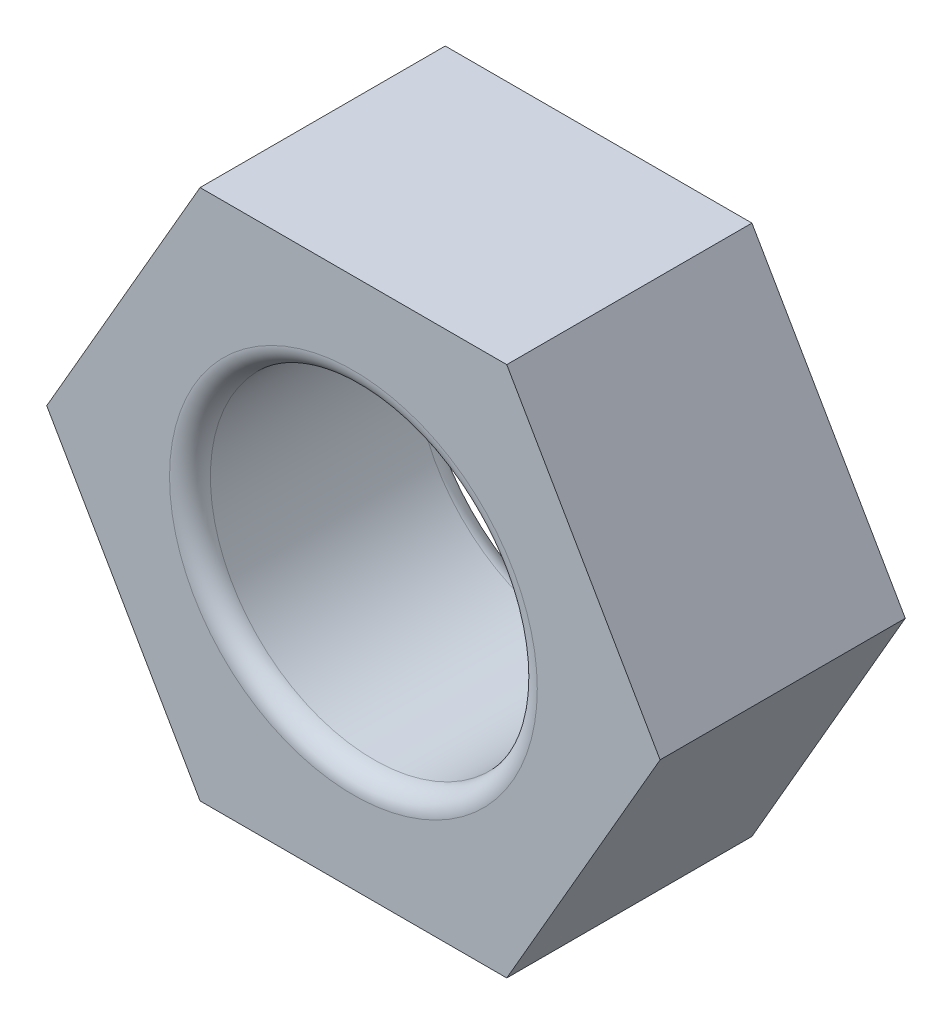
ISO-10303-21;
HEADER;
FILE_DESCRIPTION(('STEP AP214'),'2;1');
FILE_NAME('part.step','',(''),(''),'','','');
FILE_SCHEMA(('AUTOMOTIVE_DESIGN { 1 0 10303 214 1 1 1 1 }'));
ENDSEC;
DATA;
#1=APPLICATION_CONTEXT('core data for automotive mechanical design processes');
#2=APPLICATION_PROTOCOL_DEFINITION('international standard','automotive_design',2000,#1);
#3=PRODUCT_CONTEXT('',#1,'mechanical');
#4=PRODUCT('Part','Part','',(#3));
#5=PRODUCT_RELATED_PRODUCT_CATEGORY('part','',(#4));
#6=PRODUCT_DEFINITION_FORMATION('','',#4);
#7=PRODUCT_DEFINITION_CONTEXT('part definition',#1,'design');
#8=PRODUCT_DEFINITION('design','',#6,#7);
#9=PRODUCT_DEFINITION_SHAPE('','',#8);
#10=(LENGTH_UNIT() NAMED_UNIT(*) SI_UNIT(.MILLI.,.METRE.));
#11=(NAMED_UNIT(*) PLANE_ANGLE_UNIT() SI_UNIT($,.RADIAN.));
#12=(NAMED_UNIT(*) SI_UNIT($,.STERADIAN.) SOLID_ANGLE_UNIT());
#13=UNCERTAINTY_MEASURE_WITH_UNIT(LENGTH_MEASURE(1.E-05),#10,'distance_accuracy_value','');
#14=(GEOMETRIC_REPRESENTATION_CONTEXT(3) GLOBAL_UNCERTAINTY_ASSIGNED_CONTEXT((#13)) GLOBAL_UNIT_ASSIGNED_CONTEXT((#10,
#11,#12)) REPRESENTATION_CONTEXT('',''));
#15=CARTESIAN_POINT('',(0.,0.,0.));
#16=DIRECTION('',(0.,0.,1.));
#17=DIRECTION('',(1.,0.,0.));
#18=AXIS2_PLACEMENT_3D('',#15,#16,#17);
#19=CARTESIAN_POINT('',(-7.50555349946511,0.,6.));
#20=DIRECTION('',(0.,0.,1.));
#21=DIRECTION('',(1.,0.,0.));
#22=AXIS2_PLACEMENT_3D('',#19,#20,#21);
#23=PLANE('',#22);
#24=CARTESIAN_POINT('',(0.,0.,6.));
#25=DIRECTION('',(0.,0.,1.));
#26=DIRECTION('',(1.,0.,0.));
#27=AXIS2_PLACEMENT_3D('',#24,#25,#26);
#28=CIRCLE('',#27,4.5);
#29=CARTESIAN_POINT('',(4.5,0.,6.));
#30=VERTEX_POINT('',#29);
#31=EDGE_CURVE('E11',#30,#30,#28,.F.);
#32=ORIENTED_EDGE('',*,*,#31,.T.);
#33=EDGE_LOOP('',(#32));
#34=FACE_BOUND('',#33,.T.);
#35=DIRECTION('',(-0.500000000000007,-0.866025403784434,0.));
#36=VECTOR('',#35,1.);
#37=CARTESIAN_POINT('',(-3.75277674973252,6.5,6.));
#38=LINE('',#37,#36);
#39=CARTESIAN_POINT('',(-3.75277674973252,6.5,6.));
#40=VERTEX_POINT('',#39);
#41=CARTESIAN_POINT('',(-7.50555349946511,0.,6.));
#42=VERTEX_POINT('',#41);
#43=EDGE_CURVE('E125',#40,#42,#38,.T.);
#44=ORIENTED_EDGE('',*,*,#43,.T.);
#45=DIRECTION('',(0.499999999999998,-0.86602540378444,0.));
#46=VECTOR('',#45,1.);
#47=CARTESIAN_POINT('',(-7.50555349946511,0.,6.));
#48=LINE('',#47,#46);
#49=CARTESIAN_POINT('',(-3.75277674973253,-6.49999999999997,6.));
#50=VERTEX_POINT('',#49);
#51=EDGE_CURVE('E85',#42,#50,#48,.T.);
#52=ORIENTED_EDGE('',*,*,#51,.T.);
#53=DIRECTION('',(1.,0.,0.));
#54=VECTOR('',#53,1.);
#55=CARTESIAN_POINT('',(-3.75277674973253,-6.49999999999997,6.));
#56=LINE('',#55,#54);
#57=CARTESIAN_POINT('',(3.75277674973263,-6.49999999999986,6.));
#58=VERTEX_POINT('',#57);
#59=EDGE_CURVE('E97',#50,#58,#56,.T.);
#60=ORIENTED_EDGE('',*,*,#59,.T.);
#61=DIRECTION('',(0.500000000000013,0.866025403784431,0.));
#62=VECTOR('',#61,1.);
#63=CARTESIAN_POINT('',(3.75277674973263,-6.49999999999986,6.));
#64=LINE('',#63,#62);
#65=CARTESIAN_POINT('',(7.5055534994653,0.,6.));
#66=VERTEX_POINT('',#65);
#67=EDGE_CURVE('E92',#58,#66,#64,.T.);
#68=ORIENTED_EDGE('',*,*,#67,.T.);
#69=DIRECTION('',(-0.5,0.866025403784439,0.));
#70=VECTOR('',#69,1.);
#71=CARTESIAN_POINT('',(7.5055534994653,0.,6.));
#72=LINE('',#71,#70);
#73=CARTESIAN_POINT('',(3.7527767497327,6.50000000000014,6.));
#74=VERTEX_POINT('',#73);
#75=EDGE_CURVE('E95',#66,#74,#72,.T.);
#76=ORIENTED_EDGE('',*,*,#75,.T.);
#77=DIRECTION('',(-1.,0.,0.));
#78=VECTOR('',#77,1.);
#79=CARTESIAN_POINT('',(3.7527767497327,6.50000000000014,6.));
#80=LINE('',#79,#78);
#81=EDGE_CURVE('E47',#74,#40,#80,.T.);
#82=ORIENTED_EDGE('',*,*,#81,.T.);
#83=EDGE_LOOP('',(#44,#52,#60,#68,#76,#82));
#84=FACE_BOUND('',#83,.T.);
#85=ADVANCED_FACE('F30',(#34,#84),#23,.T.);
#86=CARTESIAN_POINT('',(-7.50555349946511,0.,0.));
#87=DIRECTION('',(0.,0.,1.));
#88=DIRECTION('',(1.,0.,0.));
#89=AXIS2_PLACEMENT_3D('',#86,#87,#88);
#90=PLANE('',#89);
#91=CARTESIAN_POINT('',(0.,0.,0.));
#92=DIRECTION('',(0.,0.,1.));
#93=DIRECTION('',(1.,0.,0.));
#94=AXIS2_PLACEMENT_3D('',#91,#92,#93);
#95=CIRCLE('',#94,4.5);
#96=CARTESIAN_POINT('',(4.5,0.,0.));
#97=VERTEX_POINT('',#96);
#98=EDGE_CURVE('E134',#97,#97,#95,.T.);
#99=ORIENTED_EDGE('',*,*,#98,.T.);
#100=EDGE_LOOP('',(#99));
#101=FACE_BOUND('',#100,.T.);
#102=DIRECTION('',(-0.500000000000007,-0.866025403784434,0.));
#103=VECTOR('',#102,1.);
#104=CARTESIAN_POINT('',(-3.75277674973252,6.5,0.));
#105=LINE('',#104,#103);
#106=CARTESIAN_POINT('',(-3.75277674973252,6.5,0.));
#107=VERTEX_POINT('',#106);
#108=CARTESIAN_POINT('',(-7.50555349946511,0.,0.));
#109=VERTEX_POINT('',#108);
#110=EDGE_CURVE('E115',#107,#109,#105,.T.);
#111=ORIENTED_EDGE('',*,*,#110,.F.);
#112=DIRECTION('',(-1.,0.,0.));
#113=VECTOR('',#112,1.);
#114=CARTESIAN_POINT('',(3.7527767497327,6.50000000000014,0.));
#115=LINE('',#114,#113);
#116=CARTESIAN_POINT('',(3.7527767497327,6.50000000000014,0.));
#117=VERTEX_POINT('',#116);
#118=EDGE_CURVE('E76',#117,#107,#115,.T.);
#119=ORIENTED_EDGE('',*,*,#118,.F.);
#120=DIRECTION('',(-0.5,0.866025403784439,0.));
#121=VECTOR('',#120,1.);
#122=CARTESIAN_POINT('',(7.5055534994653,0.,0.));
#123=LINE('',#122,#121);
#124=CARTESIAN_POINT('',(7.5055534994653,0.,0.));
#125=VERTEX_POINT('',#124);
#126=EDGE_CURVE('E70',#125,#117,#123,.T.);
#127=ORIENTED_EDGE('',*,*,#126,.F.);
#128=DIRECTION('',(0.500000000000013,0.866025403784431,0.));
#129=VECTOR('',#128,1.);
#130=CARTESIAN_POINT('',(3.75277674973263,-6.49999999999986,0.));
#131=LINE('',#130,#129);
#132=CARTESIAN_POINT('',(3.75277674973263,-6.49999999999986,0.));
#133=VERTEX_POINT('',#132);
#134=EDGE_CURVE('E105',#133,#125,#131,.T.);
#135=ORIENTED_EDGE('',*,*,#134,.F.);
#136=DIRECTION('',(1.,0.,0.));
#137=VECTOR('',#136,1.);
#138=CARTESIAN_POINT('',(-3.75277674973253,-6.49999999999997,0.));
#139=LINE('',#138,#137);
#140=CARTESIAN_POINT('',(-3.75277674973253,-6.49999999999997,0.));
#141=VERTEX_POINT('',#140);
#142=EDGE_CURVE('E120',#141,#133,#139,.T.);
#143=ORIENTED_EDGE('',*,*,#142,.F.);
#144=DIRECTION('',(0.499999999999998,-0.86602540378444,0.));
#145=VECTOR('',#144,1.);
#146=CARTESIAN_POINT('',(-7.50555349946511,0.,0.));
#147=LINE('',#146,#145);
#148=EDGE_CURVE('E118',#109,#141,#147,.T.);
#149=ORIENTED_EDGE('',*,*,#148,.F.);
#150=EDGE_LOOP('',(#111,#119,#127,#135,#143,#149));
#151=FACE_BOUND('',#150,.T.);
#152=ADVANCED_FACE('F150',(#101,#151),#90,.F.);
#153=CARTESIAN_POINT('',(-3.75277674973252,6.5,6.));
#154=DIRECTION('',(0.866025403784434,-0.500000000000007,0.));
#155=DIRECTION('',(0.500000000000007,0.866025403784435,0.));
#156=AXIS2_PLACEMENT_3D('',#153,#154,#155);
#157=PLANE('',#156);
#158=ORIENTED_EDGE('',*,*,#110,.T.);
#159=DIRECTION('',(0.,0.,-1.));
#160=VECTOR('',#159,1.);
#161=CARTESIAN_POINT('',(-7.50555349946511,0.,6.));
#162=LINE('',#161,#160);
#163=EDGE_CURVE('E132',#42,#109,#162,.T.);
#164=ORIENTED_EDGE('',*,*,#163,.F.);
#165=ORIENTED_EDGE('',*,*,#43,.F.);
#166=DIRECTION('',(0.,0.,-1.));
#167=VECTOR('',#166,1.);
#168=CARTESIAN_POINT('',(-3.75277674973252,6.5,6.));
#169=LINE('',#168,#167);
#170=EDGE_CURVE('E111',#40,#107,#169,.T.);
#171=ORIENTED_EDGE('',*,*,#170,.T.);
#172=EDGE_LOOP('',(#158,#164,#165,#171));
#173=FACE_BOUND('',#172,.T.);
#174=ADVANCED_FACE('F153',(#173),#157,.F.);
#175=CARTESIAN_POINT('',(-7.50555349946511,0.,6.));
#176=DIRECTION('',(0.86602540378444,0.499999999999998,0.));
#177=DIRECTION('',(-0.499999999999998,0.86602540378444,0.));
#178=AXIS2_PLACEMENT_3D('',#175,#176,#177);
#179=PLANE('',#178);
#180=ORIENTED_EDGE('',*,*,#148,.T.);
#181=DIRECTION('',(0.,0.,-1.));
#182=VECTOR('',#181,1.);
#183=CARTESIAN_POINT('',(-3.75277674973253,-6.49999999999997,6.));
#184=LINE('',#183,#182);
#185=EDGE_CURVE('E129',#50,#141,#184,.T.);
#186=ORIENTED_EDGE('',*,*,#185,.F.);
#187=ORIENTED_EDGE('',*,*,#51,.F.);
#188=ORIENTED_EDGE('',*,*,#163,.T.);
#189=EDGE_LOOP('',(#180,#186,#187,#188));
#190=FACE_BOUND('',#189,.T.);
#191=ADVANCED_FACE('F229',(#190),#179,.F.);
#192=CARTESIAN_POINT('',(-3.75277674973253,-6.49999999999997,6.));
#193=DIRECTION('',(0.,1.,0.));
#194=DIRECTION('',(-1.,0.,0.));
#195=AXIS2_PLACEMENT_3D('',#192,#193,#194);
#196=PLANE('',#195);
#197=ORIENTED_EDGE('',*,*,#142,.T.);
#198=DIRECTION('',(0.,0.,-1.));
#199=VECTOR('',#198,1.);
#200=CARTESIAN_POINT('',(3.75277674973263,-6.49999999999986,6.));
#201=LINE('',#200,#199);
#202=EDGE_CURVE('E106',#58,#133,#201,.T.);
#203=ORIENTED_EDGE('',*,*,#202,.F.);
#204=ORIENTED_EDGE('',*,*,#59,.F.);
#205=ORIENTED_EDGE('',*,*,#185,.T.);
#206=EDGE_LOOP('',(#197,#203,#204,#205));
#207=FACE_BOUND('',#206,.T.);
#208=ADVANCED_FACE('F220',(#207),#196,.F.);
#209=CARTESIAN_POINT('',(3.75277674973263,-6.49999999999986,6.));
#210=DIRECTION('',(-0.866025403784431,0.500000000000013,0.));
#211=DIRECTION('',(-0.500000000000013,-0.866025403784431,0.));
#212=AXIS2_PLACEMENT_3D('',#209,#210,#211);
#213=PLANE('',#212);
#214=ORIENTED_EDGE('',*,*,#134,.T.);
#215=DIRECTION('',(0.,0.,-1.));
#216=VECTOR('',#215,1.);
#217=CARTESIAN_POINT('',(7.5055534994653,0.,6.));
#218=LINE('',#217,#216);
#219=EDGE_CURVE('E102',#66,#125,#218,.T.);
#220=ORIENTED_EDGE('',*,*,#219,.F.);
#221=ORIENTED_EDGE('',*,*,#67,.F.);
#222=ORIENTED_EDGE('',*,*,#202,.T.);
#223=EDGE_LOOP('',(#214,#220,#221,#222));
#224=FACE_BOUND('',#223,.T.);
#225=ADVANCED_FACE('F103',(#224),#213,.F.);
#226=CARTESIAN_POINT('',(7.5055534994653,0.,6.));
#227=DIRECTION('',(-0.866025403784439,-0.5,0.));
#228=DIRECTION('',(0.5,-0.866025403784439,0.));
#229=AXIS2_PLACEMENT_3D('',#226,#227,#228);
#230=PLANE('',#229);
#231=ORIENTED_EDGE('',*,*,#126,.T.);
#232=DIRECTION('',(0.,0.,-1.));
#233=VECTOR('',#232,1.);
#234=CARTESIAN_POINT('',(3.7527767497327,6.50000000000014,6.));
#235=LINE('',#234,#233);
#236=EDGE_CURVE('E107',#74,#117,#235,.T.);
#237=ORIENTED_EDGE('',*,*,#236,.F.);
#238=ORIENTED_EDGE('',*,*,#75,.F.);
#239=ORIENTED_EDGE('',*,*,#219,.T.);
#240=EDGE_LOOP('',(#231,#237,#238,#239));
#241=FACE_BOUND('',#240,.T.);
#242=ADVANCED_FACE('F109',(#241),#230,.F.);
#243=CARTESIAN_POINT('',(3.7527767497327,6.50000000000014,6.));
#244=DIRECTION('',(0.,-1.,0.));
#245=DIRECTION('',(1.,0.,0.));
#246=AXIS2_PLACEMENT_3D('',#243,#244,#245);
#247=PLANE('',#246);
#248=ORIENTED_EDGE('',*,*,#118,.T.);
#249=ORIENTED_EDGE('',*,*,#170,.F.);
#250=ORIENTED_EDGE('',*,*,#81,.F.);
#251=ORIENTED_EDGE('',*,*,#236,.T.);
#252=EDGE_LOOP('',(#248,#249,#250,#251));
#253=FACE_BOUND('',#252,.T.);
#254=ADVANCED_FACE('F160',(#253),#247,.F.);
#255=CARTESIAN_POINT('',(0.,0.,6.));
#256=DIRECTION('',(0.,0.,-1.));
#257=DIRECTION('',(-1.,0.,0.));
#258=AXIS2_PLACEMENT_3D('',#255,#256,#257);
#259=CYLINDRICAL_SURFACE('',#258,4.);
#260=CARTESIAN_POINT('',(0.,0.,0.5));
#261=DIRECTION('',(0.,0.,1.));
#262=DIRECTION('',(1.,0.,0.));
#263=AXIS2_PLACEMENT_3D('',#260,#261,#262);
#264=CIRCLE('',#263,4.);
#265=CARTESIAN_POINT('',(4.,0.,0.5));
#266=VERTEX_POINT('',#265);
#267=EDGE_CURVE('E39',#266,#266,#264,.F.);
#268=ORIENTED_EDGE('',*,*,#267,.T.);
#269=EDGE_LOOP('',(#268));
#270=FACE_BOUND('',#269,.T.);
#271=CARTESIAN_POINT('',(0.,0.,5.5));
#272=DIRECTION('',(0.,0.,1.));
#273=DIRECTION('',(1.,0.,0.));
#274=AXIS2_PLACEMENT_3D('',#271,#272,#273);
#275=CIRCLE('',#274,4.);
#276=CARTESIAN_POINT('',(4.,0.,5.5));
#277=VERTEX_POINT('',#276);
#278=EDGE_CURVE('E137',#277,#277,#275,.T.);
#279=ORIENTED_EDGE('',*,*,#278,.T.);
#280=EDGE_LOOP('',(#279));
#281=FACE_BOUND('',#280,.T.);
#282=ADVANCED_FACE('F142',(#270,#281),#259,.F.);
#283=CARTESIAN_POINT('',(0.,0.,0.5));
#284=DIRECTION('',(0.,0.,1.));
#285=DIRECTION('',(1.,0.,0.));
#286=AXIS2_PLACEMENT_3D('',#283,#284,#285);
#287=TOROIDAL_SURFACE('',#286,4.5,0.5);
#288=ORIENTED_EDGE('',*,*,#267,.F.);
#289=EDGE_LOOP('',(#288));
#290=FACE_BOUND('',#289,.T.);
#291=ORIENTED_EDGE('',*,*,#98,.F.);
#292=EDGE_LOOP('',(#291));
#293=FACE_BOUND('',#292,.T.);
#294=ADVANCED_FACE('F145',(#290,#293),#287,.T.);
#295=CARTESIAN_POINT('',(0.,0.,5.5));
#296=DIRECTION('',(0.,0.,1.));
#297=DIRECTION('',(1.,0.,0.));
#298=AXIS2_PLACEMENT_3D('',#295,#296,#297);
#299=TOROIDAL_SURFACE('',#298,4.5,0.5);
#300=ORIENTED_EDGE('',*,*,#31,.F.);
#301=EDGE_LOOP('',(#300));
#302=FACE_BOUND('',#301,.T.);
#303=ORIENTED_EDGE('',*,*,#278,.F.);
#304=EDGE_LOOP('',(#303));
#305=FACE_BOUND('',#304,.T.);
#306=ADVANCED_FACE('F32',(#302,#305),#299,.T.);
#307=CLOSED_SHELL('',(#85,#152,#174,#191,#208,#225,#242,#254,#282,#294,#306));
#308=MANIFOLD_SOLID_BREP('B2',#307);
#309=ADVANCED_BREP_SHAPE_REPRESENTATION('',(#18,#308),#14);
#310=SHAPE_DEFINITION_REPRESENTATION(#9,#309);
ENDSEC;
END-ISO-10303-21;
